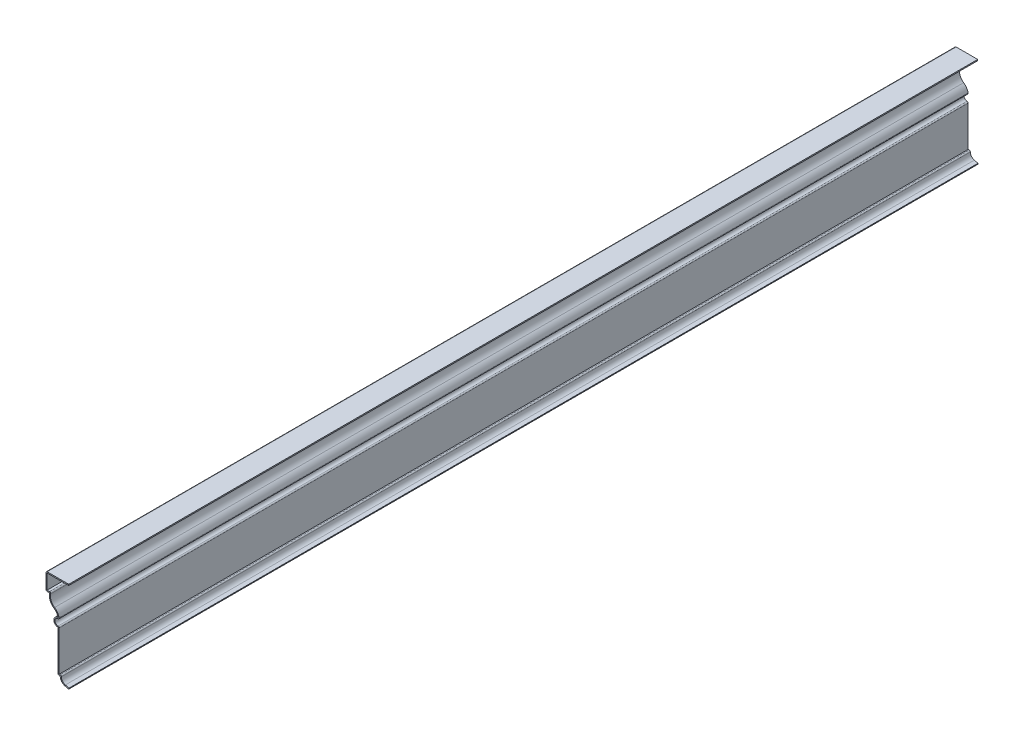
ISO-10303-21;
HEADER;
FILE_DESCRIPTION(('STEP AP214'),'2;1');
FILE_NAME('part.step','',(''),(''),'','','');
FILE_SCHEMA(('AUTOMOTIVE_DESIGN { 1 0 10303 214 1 1 1 1 }'));
ENDSEC;
DATA;
#1=APPLICATION_CONTEXT('core data for automotive mechanical design processes');
#2=APPLICATION_PROTOCOL_DEFINITION('international standard','automotive_design',2000,#1);
#3=PRODUCT_CONTEXT('',#1,'mechanical');
#4=PRODUCT('Part','Part','',(#3));
#5=PRODUCT_RELATED_PRODUCT_CATEGORY('part','',(#4));
#6=PRODUCT_DEFINITION_FORMATION('','',#4);
#7=PRODUCT_DEFINITION_CONTEXT('part definition',#1,'design');
#8=PRODUCT_DEFINITION('design','',#6,#7);
#9=PRODUCT_DEFINITION_SHAPE('','',#8);
#10=(LENGTH_UNIT() NAMED_UNIT(*) SI_UNIT(.MILLI.,.METRE.));
#11=(NAMED_UNIT(*) PLANE_ANGLE_UNIT() SI_UNIT($,.RADIAN.));
#12=(NAMED_UNIT(*) SI_UNIT($,.STERADIAN.) SOLID_ANGLE_UNIT());
#13=UNCERTAINTY_MEASURE_WITH_UNIT(LENGTH_MEASURE(1.E-05),#10,'distance_accuracy_value','');
#14=(GEOMETRIC_REPRESENTATION_CONTEXT(3) GLOBAL_UNCERTAINTY_ASSIGNED_CONTEXT((#13)) GLOBAL_UNIT_ASSIGNED_CONTEXT((#10,
#11,#12)) REPRESENTATION_CONTEXT('',''));
#15=CARTESIAN_POINT('',(0.,0.,0.));
#16=DIRECTION('',(0.,0.,1.));
#17=DIRECTION('',(1.,0.,0.));
#18=AXIS2_PLACEMENT_3D('',#15,#16,#17);
#19=CARTESIAN_POINT('',(-25.4,100.33,-1016.));
#20=DIRECTION('',(0.,-1.,0.));
#21=DIRECTION('',(0.,0.,-1.));
#22=AXIS2_PLACEMENT_3D('',#19,#20,#21);
#23=PLANE('',#22);
#24=DIRECTION('',(1.,0.,0.));
#25=VECTOR('',#24,1.);
#26=CARTESIAN_POINT('',(-25.4,100.33,0.));
#27=LINE('',#26,#25);
#28=CARTESIAN_POINT('',(-24.13,100.33,0.));
#29=VERTEX_POINT('',#28);
#30=CARTESIAN_POINT('',(0.,100.33,0.));
#31=VERTEX_POINT('',#30);
#32=EDGE_CURVE('E303',#29,#31,#27,.T.);
#33=ORIENTED_EDGE('',*,*,#32,.F.);
#34=DIRECTION('',(0.,0.,1.));
#35=VECTOR('',#34,1.);
#36=CARTESIAN_POINT('',(-24.13,100.33,-1016.));
#37=LINE('',#36,#35);
#38=CARTESIAN_POINT('',(-24.13,100.33,-1016.));
#39=VERTEX_POINT('',#38);
#40=EDGE_CURVE('E251',#39,#29,#37,.T.);
#41=ORIENTED_EDGE('',*,*,#40,.F.);
#42=DIRECTION('',(1.,0.,0.));
#43=VECTOR('',#42,1.);
#44=CARTESIAN_POINT('',(-25.4,100.33,-1016.));
#45=LINE('',#44,#43);
#46=CARTESIAN_POINT('',(0.,100.33,-1016.));
#47=VERTEX_POINT('',#46);
#48=EDGE_CURVE('E233',#39,#47,#45,.T.);
#49=ORIENTED_EDGE('',*,*,#48,.T.);
#50=DIRECTION('',(0.,0.,1.));
#51=VECTOR('',#50,1.);
#52=CARTESIAN_POINT('',(0.,100.33,-1016.));
#53=LINE('',#52,#51);
#54=EDGE_CURVE('E241',#47,#31,#53,.T.);
#55=ORIENTED_EDGE('',*,*,#54,.T.);
#56=EDGE_LOOP('',(#33,#41,#49,#55));
#57=FACE_BOUND('',#56,.T.);
#58=ADVANCED_FACE('F35',(#57),#23,.T.);
#59=CARTESIAN_POINT('',(-24.13,82.55,-1016.));
#60=DIRECTION('',(1.,0.,0.));
#61=DIRECTION('',(0.,0.,-1.));
#62=AXIS2_PLACEMENT_3D('',#59,#60,#61);
#63=PLANE('',#62);
#64=DIRECTION('',(0.,1.,0.));
#65=VECTOR('',#64,1.);
#66=CARTESIAN_POINT('',(-24.13,82.55,0.));
#67=LINE('',#66,#65);
#68=CARTESIAN_POINT('',(-24.13,83.82,0.));
#69=VERTEX_POINT('',#68);
#70=EDGE_CURVE('E252',#69,#29,#67,.T.);
#71=ORIENTED_EDGE('',*,*,#70,.F.);
#72=DIRECTION('',(0.,0.,1.));
#73=VECTOR('',#72,1.);
#74=CARTESIAN_POINT('',(-24.13,83.82,-1016.));
#75=LINE('',#74,#73);
#76=CARTESIAN_POINT('',(-24.13,83.82,-1016.));
#77=VERTEX_POINT('',#76);
#78=EDGE_CURVE('E352',#77,#69,#75,.T.);
#79=ORIENTED_EDGE('',*,*,#78,.F.);
#80=DIRECTION('',(0.,1.,0.));
#81=VECTOR('',#80,1.);
#82=CARTESIAN_POINT('',(-24.13,82.55,-1016.));
#83=LINE('',#82,#81);
#84=EDGE_CURVE('E249',#77,#39,#83,.T.);
#85=ORIENTED_EDGE('',*,*,#84,.T.);
#86=ORIENTED_EDGE('',*,*,#40,.T.);
#87=EDGE_LOOP('',(#71,#79,#85,#86));
#88=FACE_BOUND('',#87,.T.);
#89=ADVANCED_FACE('F465',(#88),#63,.T.);
#90=CARTESIAN_POINT('',(-21.43125,83.82,-1016.));
#91=DIRECTION('',(0.,1.,0.));
#92=DIRECTION('',(0.,0.,1.));
#93=AXIS2_PLACEMENT_3D('',#90,#91,#92);
#94=PLANE('',#93);
#95=DIRECTION('',(1.,0.,0.));
#96=VECTOR('',#95,1.);
#97=CARTESIAN_POINT('',(-21.43125,83.82,0.));
#98=LINE('',#97,#96);
#99=CARTESIAN_POINT('',(-21.43125,83.82,0.));
#100=VERTEX_POINT('',#99);
#101=EDGE_CURVE('E255',#100,#69,#98,.F.);
#102=ORIENTED_EDGE('',*,*,#101,.F.);
#103=DIRECTION('',(0.,0.,1.));
#104=VECTOR('',#103,1.);
#105=CARTESIAN_POINT('',(-21.43125,83.82,-1016.));
#106=LINE('',#105,#104);
#107=CARTESIAN_POINT('',(-21.43125,83.82,-1016.));
#108=VERTEX_POINT('',#107);
#109=EDGE_CURVE('E436',#100,#108,#106,.F.);
#110=ORIENTED_EDGE('',*,*,#109,.T.);
#111=DIRECTION('',(1.,0.,0.));
#112=VECTOR('',#111,1.);
#113=CARTESIAN_POINT('',(-21.43125,83.82,-1016.));
#114=LINE('',#113,#112);
#115=EDGE_CURVE('E300',#108,#77,#114,.F.);
#116=ORIENTED_EDGE('',*,*,#115,.T.);
#117=ORIENTED_EDGE('',*,*,#78,.T.);
#118=EDGE_LOOP('',(#102,#110,#116,#117));
#119=FACE_BOUND('',#118,.T.);
#120=ADVANCED_FACE('F570',(#119),#94,.T.);
#121=CARTESIAN_POINT('',(-9.80109653950941,80.0008198282702,-1016.));
#122=DIRECTION('',(0.,0.,1.));
#123=DIRECTION('',(1.,0.,0.));
#124=AXIS2_PLACEMENT_3D('',#121,#122,#123);
#125=CYLINDRICAL_SURFACE('',#124,10.63625);
#126=CARTESIAN_POINT('',(-9.80109653950941,80.0008198282702,-1016.));
#127=DIRECTION('',(0.,0.,1.));
#128=DIRECTION('',(1.,0.,0.));
#129=AXIS2_PLACEMENT_3D('',#126,#127,#128);
#130=CIRCLE('',#129,10.63625);
#131=CARTESIAN_POINT('',(-15.7716346624496,71.1984060351667,-1016.));
#132=VERTEX_POINT('',#131);
#133=CARTESIAN_POINT('',(-20.1907002975476,82.2780874483488,-1016.));
#134=VERTEX_POINT('',#133);
#135=EDGE_CURVE('E297',#132,#134,#130,.F.);
#136=ORIENTED_EDGE('',*,*,#135,.T.);
#137=DIRECTION('',(0.,0.,1.));
#138=VECTOR('',#137,1.);
#139=CARTESIAN_POINT('',(-20.1907002975476,82.2780874483488,-1016.));
#140=LINE('',#139,#138);
#141=CARTESIAN_POINT('',(-20.1907002975476,82.2780874483488,0.));
#142=VERTEX_POINT('',#141);
#143=EDGE_CURVE('E433',#134,#142,#140,.T.);
#144=ORIENTED_EDGE('',*,*,#143,.T.);
#145=CARTESIAN_POINT('',(-9.80109653950941,80.0008198282702,0.));
#146=DIRECTION('',(0.,0.,1.));
#147=DIRECTION('',(1.,0.,0.));
#148=AXIS2_PLACEMENT_3D('',#145,#146,#147);
#149=CIRCLE('',#148,10.63625);
#150=CARTESIAN_POINT('',(-15.7716346624496,71.1984060351667,0.));
#151=VERTEX_POINT('',#150);
#152=EDGE_CURVE('E346',#151,#142,#149,.F.);
#153=ORIENTED_EDGE('',*,*,#152,.F.);
#154=DIRECTION('',(0.,0.,1.));
#155=VECTOR('',#154,1.);
#156=CARTESIAN_POINT('',(-15.7716346624496,71.1984060351667,-1016.));
#157=LINE('',#156,#155);
#158=EDGE_CURVE('E355',#132,#151,#157,.T.);
#159=ORIENTED_EDGE('',*,*,#158,.F.);
#160=EDGE_LOOP('',(#136,#144,#153,#159));
#161=FACE_BOUND('',#160,.T.);
#162=ADVANCED_FACE('F476',(#161),#125,.F.);
#163=CARTESIAN_POINT('',(-22.7224103876636,60.9508198282702,-1016.));
#164=DIRECTION('',(0.,0.,1.));
#165=DIRECTION('',(1.,0.,0.));
#166=AXIS2_PLACEMENT_3D('',#163,#164,#165);
#167=CYLINDRICAL_SURFACE('',#166,12.3825);
#168=CARTESIAN_POINT('',(-22.7224103876636,60.9508198282702,0.));
#169=DIRECTION('',(0.,0.,1.));
#170=DIRECTION('',(1.,0.,0.));
#171=AXIS2_PLACEMENT_3D('',#168,#169,#170);
#172=CIRCLE('',#171,12.3825);
#173=CARTESIAN_POINT('',(-10.6701168088773,63.7913348767691,0.));
#174=VERTEX_POINT('',#173);
#175=EDGE_CURVE('E344',#174,#151,#172,.T.);
#176=ORIENTED_EDGE('',*,*,#175,.F.);
#177=DIRECTION('',(0.,0.,1.));
#178=VECTOR('',#177,1.);
#179=CARTESIAN_POINT('',(-10.6701168088773,63.7913348767691,-1016.));
#180=LINE('',#179,#178);
#181=CARTESIAN_POINT('',(-10.6701168088773,63.7913348767691,-1016.));
#182=VERTEX_POINT('',#181);
#183=EDGE_CURVE('E431',#174,#182,#180,.F.);
#184=ORIENTED_EDGE('',*,*,#183,.T.);
#185=CARTESIAN_POINT('',(-22.7224103876636,60.9508198282702,-1016.));
#186=DIRECTION('',(0.,0.,1.));
#187=DIRECTION('',(1.,0.,0.));
#188=AXIS2_PLACEMENT_3D('',#185,#186,#187);
#189=CIRCLE('',#188,12.3825);
#190=EDGE_CURVE('E295',#182,#132,#189,.T.);
#191=ORIENTED_EDGE('',*,*,#190,.T.);
#192=ORIENTED_EDGE('',*,*,#158,.T.);
#193=EDGE_LOOP('',(#176,#184,#191,#192));
#194=FACE_BOUND('',#193,.T.);
#195=ADVANCED_FACE('F481',(#194),#167,.T.);
#196=CARTESIAN_POINT('',(-11.90625,58.7375,-1016.));
#197=DIRECTION('',(0.,0.,1.));
#198=DIRECTION('',(1.,0.,0.));
#199=AXIS2_PLACEMENT_3D('',#196,#197,#198);
#200=CYLINDRICAL_SURFACE('',#199,3.49250000000002);
#201=CARTESIAN_POINT('',(-11.90625,58.7375,0.));
#202=DIRECTION('',(0.,0.,1.));
#203=DIRECTION('',(1.,0.,0.));
#204=AXIS2_PLACEMENT_3D('',#201,#202,#203);
#205=CIRCLE('',#204,3.49250000000002);
#206=CARTESIAN_POINT('',(-11.90625,55.245,0.));
#207=VERTEX_POINT('',#206);
#208=CARTESIAN_POINT('',(-11.9062496213247,62.23,0.));
#209=VERTEX_POINT('',#208);
#210=EDGE_CURVE('E341',#207,#209,#205,.F.);
#211=ORIENTED_EDGE('',*,*,#210,.F.);
#212=DIRECTION('',(0.,0.,1.));
#213=VECTOR('',#212,1.);
#214=CARTESIAN_POINT('',(-11.90625,55.245,-1016.));
#215=LINE('',#214,#213);
#216=CARTESIAN_POINT('',(-11.90625,55.245,-1016.));
#217=VERTEX_POINT('',#216);
#218=EDGE_CURVE('E429',#207,#217,#215,.F.);
#219=ORIENTED_EDGE('',*,*,#218,.T.);
#220=CARTESIAN_POINT('',(-11.90625,58.7375,-1016.));
#221=DIRECTION('',(0.,0.,1.));
#222=DIRECTION('',(1.,0.,0.));
#223=AXIS2_PLACEMENT_3D('',#220,#221,#222);
#224=CIRCLE('',#223,3.49250000000002);
#225=CARTESIAN_POINT('',(-11.9062496213247,62.23,-1016.));
#226=VERTEX_POINT('',#225);
#227=EDGE_CURVE('E292',#217,#226,#224,.F.);
#228=ORIENTED_EDGE('',*,*,#227,.T.);
#229=DIRECTION('',(0.,0.,1.));
#230=VECTOR('',#229,1.);
#231=CARTESIAN_POINT('',(-11.9062496213247,62.23,-1016.));
#232=LINE('',#231,#230);
#233=EDGE_CURVE('E426',#226,#209,#232,.T.);
#234=ORIENTED_EDGE('',*,*,#233,.T.);
#235=EDGE_LOOP('',(#211,#219,#228,#234));
#236=FACE_BOUND('',#235,.T.);
#237=ADVANCED_FACE('F490',(#236),#200,.F.);
#238=CARTESIAN_POINT('',(-10.63625,7.9375,-1016.));
#239=DIRECTION('',(1.,0.,0.));
#240=DIRECTION('',(0.,0.,-1.));
#241=AXIS2_PLACEMENT_3D('',#238,#239,#240);
#242=PLANE('',#241);
#243=DIRECTION('',(0.,1.,0.));
#244=VECTOR('',#243,1.);
#245=CARTESIAN_POINT('',(-10.63625,7.9375,-1016.));
#246=LINE('',#245,#244);
#247=CARTESIAN_POINT('',(-10.63625,9.2075,-1016.));
#248=VERTEX_POINT('',#247);
#249=CARTESIAN_POINT('',(-10.63625,53.975,-1016.));
#250=VERTEX_POINT('',#249);
#251=EDGE_CURVE('E289',#248,#250,#246,.T.);
#252=ORIENTED_EDGE('',*,*,#251,.T.);
#253=DIRECTION('',(0.,0.,1.));
#254=VECTOR('',#253,1.);
#255=CARTESIAN_POINT('',(-10.63625,53.975,-1016.));
#256=LINE('',#255,#254);
#257=CARTESIAN_POINT('',(-10.63625,53.975,0.));
#258=VERTEX_POINT('',#257);
#259=EDGE_CURVE('E423',#250,#258,#256,.T.);
#260=ORIENTED_EDGE('',*,*,#259,.T.);
#261=DIRECTION('',(0.,1.,0.));
#262=VECTOR('',#261,1.);
#263=CARTESIAN_POINT('',(-10.63625,7.9375,0.));
#264=LINE('',#263,#262);
#265=CARTESIAN_POINT('',(-10.63625,9.2075,0.));
#266=VERTEX_POINT('',#265);
#267=EDGE_CURVE('E338',#266,#258,#264,.T.);
#268=ORIENTED_EDGE('',*,*,#267,.F.);
#269=DIRECTION('',(0.,0.,1.));
#270=VECTOR('',#269,1.);
#271=CARTESIAN_POINT('',(-10.63625,9.2075,-1016.));
#272=LINE('',#271,#270);
#273=EDGE_CURVE('E358',#248,#266,#272,.T.);
#274=ORIENTED_EDGE('',*,*,#273,.F.);
#275=EDGE_LOOP('',(#252,#260,#268,#274));
#276=FACE_BOUND('',#275,.T.);
#277=ADVANCED_FACE('F498',(#276),#242,.T.);
#278=CARTESIAN_POINT('',(-9.525,9.2075,-1016.));
#279=DIRECTION('',(0.,1.,0.));
#280=DIRECTION('',(-1.,0.,0.));
#281=AXIS2_PLACEMENT_3D('',#278,#279,#280);
#282=PLANE('',#281);
#283=DIRECTION('',(-1.,0.,0.));
#284=VECTOR('',#283,1.);
#285=CARTESIAN_POINT('',(-9.525,9.2075,0.));
#286=LINE('',#285,#284);
#287=CARTESIAN_POINT('',(-9.525,9.2075,0.));
#288=VERTEX_POINT('',#287);
#289=EDGE_CURVE('E336',#288,#266,#286,.T.);
#290=ORIENTED_EDGE('',*,*,#289,.F.);
#291=DIRECTION('',(0.,0.,1.));
#292=VECTOR('',#291,1.);
#293=CARTESIAN_POINT('',(-9.525,9.2075,-1016.));
#294=LINE('',#293,#292);
#295=CARTESIAN_POINT('',(-9.525,9.2075,-1016.));
#296=VERTEX_POINT('',#295);
#297=EDGE_CURVE('E403',#288,#296,#294,.F.);
#298=ORIENTED_EDGE('',*,*,#297,.T.);
#299=DIRECTION('',(-1.,0.,0.));
#300=VECTOR('',#299,1.);
#301=CARTESIAN_POINT('',(-9.525,9.2075,-1016.));
#302=LINE('',#301,#300);
#303=EDGE_CURVE('E287',#296,#248,#302,.T.);
#304=ORIENTED_EDGE('',*,*,#303,.T.);
#305=ORIENTED_EDGE('',*,*,#273,.T.);
#306=EDGE_LOOP('',(#290,#298,#304,#305));
#307=FACE_BOUND('',#306,.T.);
#308=ADVANCED_FACE('F695',(#307),#282,.T.);
#309=CARTESIAN_POINT('',(-2.38125,7.9375,-1016.));
#310=DIRECTION('',(0.,0.,1.));
#311=DIRECTION('',(1.,0.,0.));
#312=AXIS2_PLACEMENT_3D('',#309,#310,#311);
#313=CYLINDRICAL_SURFACE('',#312,5.87375);
#314=CARTESIAN_POINT('',(-2.38125,7.9375,-1016.));
#315=DIRECTION('',(0.,0.,1.));
#316=DIRECTION('',(1.,0.,0.));
#317=AXIS2_PLACEMENT_3D('',#314,#315,#316);
#318=CIRCLE('',#317,5.87375);
#319=CARTESIAN_POINT('',(-3.77774894740654,2.23217531577804,-1016.));
#320=VERTEX_POINT('',#319);
#321=CARTESIAN_POINT('',(-8.255,7.9375,-1016.));
#322=VERTEX_POINT('',#321);
#323=EDGE_CURVE('E284',#320,#322,#318,.F.);
#324=ORIENTED_EDGE('',*,*,#323,.T.);
#325=DIRECTION('',(0.,0.,1.));
#326=VECTOR('',#325,1.);
#327=CARTESIAN_POINT('',(-8.255,7.9375,-1016.));
#328=LINE('',#327,#326);
#329=CARTESIAN_POINT('',(-8.255,7.9375,0.));
#330=VERTEX_POINT('',#329);
#331=EDGE_CURVE('E351',#322,#330,#328,.T.);
#332=ORIENTED_EDGE('',*,*,#331,.T.);
#333=CARTESIAN_POINT('',(-2.38125,7.9375,0.));
#334=DIRECTION('',(0.,0.,1.));
#335=DIRECTION('',(1.,0.,0.));
#336=AXIS2_PLACEMENT_3D('',#333,#334,#335);
#337=CIRCLE('',#336,5.87375);
#338=CARTESIAN_POINT('',(-3.77774894740654,2.23217531577804,0.));
#339=VERTEX_POINT('',#338);
#340=EDGE_CURVE('E333',#339,#330,#337,.F.);
#341=ORIENTED_EDGE('',*,*,#340,.F.);
#342=DIRECTION('',(0.,0.,1.));
#343=VECTOR('',#342,1.);
#344=CARTESIAN_POINT('',(-3.77774894740654,2.23217531577804,-1016.));
#345=LINE('',#344,#343);
#346=EDGE_CURVE('E361',#320,#339,#345,.T.);
#347=ORIENTED_EDGE('',*,*,#346,.F.);
#348=EDGE_LOOP('',(#324,#332,#341,#347));
#349=FACE_BOUND('',#348,.T.);
#350=ADVANCED_FACE('F510',(#349),#313,.F.);
#351=CARTESIAN_POINT('',(0.301945718358171,1.23358371550745,-1016.));
#352=DIRECTION('',(0.237752534140292,0.971325760242087,0.));
#353=DIRECTION('',(-0.971325760242088,0.237752534140292,0.));
#354=AXIS2_PLACEMENT_3D('',#351,#352,#353);
#355=PLANE('',#354);
#356=DIRECTION('',(-0.971325760242088,0.237752534140292,0.));
#357=VECTOR('',#356,1.);
#358=CARTESIAN_POINT('',(0.301945718358171,1.23358371550745,0.));
#359=LINE('',#358,#357);
#360=CARTESIAN_POINT('',(0.301945718358171,1.23358371550745,0.));
#361=VERTEX_POINT('',#360);
#362=EDGE_CURVE('E330',#361,#339,#359,.T.);
#363=ORIENTED_EDGE('',*,*,#362,.F.);
#364=DIRECTION('',(0.,0.,1.));
#365=VECTOR('',#364,1.);
#366=CARTESIAN_POINT('',(0.301945718358171,1.23358371550745,-1016.));
#367=LINE('',#366,#365);
#368=CARTESIAN_POINT('',(0.301945718358171,1.23358371550745,-1016.));
#369=VERTEX_POINT('',#368);
#370=EDGE_CURVE('E363',#369,#361,#367,.T.);
#371=ORIENTED_EDGE('',*,*,#370,.F.);
#372=DIRECTION('',(-0.971325760242088,0.237752534140292,0.));
#373=VECTOR('',#372,1.);
#374=CARTESIAN_POINT('',(0.301945718358171,1.23358371550745,-1016.));
#375=LINE('',#374,#373);
#376=EDGE_CURVE('E281',#369,#320,#375,.T.);
#377=ORIENTED_EDGE('',*,*,#376,.T.);
#378=ORIENTED_EDGE('',*,*,#346,.T.);
#379=EDGE_LOOP('',(#363,#371,#377,#378));
#380=FACE_BOUND('',#379,.T.);
#381=ADVANCED_FACE('F516',(#380),#355,.T.);
#382=CARTESIAN_POINT('',(0.301945718358171,1.23358371550745,-1016.));
#383=DIRECTION('',(-0.971325760242087,0.237752534140292,0.));
#384=DIRECTION('',(-0.237752534140292,-0.971325760242088,0.));
#385=AXIS2_PLACEMENT_3D('',#382,#383,#384);
#386=PLANE('',#385);
#387=DIRECTION('',(-0.237752534140292,-0.971325760242087,0.));
#388=VECTOR('',#387,1.);
#389=CARTESIAN_POINT('',(0.301945718358171,1.23358371550745,0.));
#390=LINE('',#389,#388);
#391=CARTESIAN_POINT('',(0.,0.,0.));
#392=VERTEX_POINT('',#391);
#393=EDGE_CURVE('E328',#361,#392,#390,.T.);
#394=ORIENTED_EDGE('',*,*,#393,.T.);
#395=DIRECTION('',(0.,0.,1.));
#396=VECTOR('',#395,1.);
#397=CARTESIAN_POINT('',(0.,0.,-1016.));
#398=LINE('',#397,#396);
#399=CARTESIAN_POINT('',(0.,0.,-1016.));
#400=VERTEX_POINT('',#399);
#401=EDGE_CURVE('E365',#400,#392,#398,.T.);
#402=ORIENTED_EDGE('',*,*,#401,.F.);
#403=DIRECTION('',(-0.237752534140292,-0.971325760242087,0.));
#404=VECTOR('',#403,1.);
#405=CARTESIAN_POINT('',(0.301945718358171,1.23358371550745,-1016.));
#406=LINE('',#405,#404);
#407=EDGE_CURVE('E279',#369,#400,#406,.T.);
#408=ORIENTED_EDGE('',*,*,#407,.F.);
#409=ORIENTED_EDGE('',*,*,#370,.T.);
#410=EDGE_LOOP('',(#394,#402,#408,#409));
#411=FACE_BOUND('',#410,.T.);
#412=ADVANCED_FACE('F523',(#411),#386,.F.);
#413=CARTESIAN_POINT('',(0.,0.,-1016.));
#414=DIRECTION('',(0.237752534140292,0.971325760242087,0.));
#415=DIRECTION('',(-0.971325760242087,0.237752534140292,0.));
#416=AXIS2_PLACEMENT_3D('',#413,#414,#415);
#417=PLANE('',#416);
#418=DIRECTION('',(-0.971325760242087,0.237752534140292,0.));
#419=VECTOR('',#418,1.);
#420=CARTESIAN_POINT('',(0.,0.,0.));
#421=LINE('',#420,#419);
#422=CARTESIAN_POINT('',(-4.07969466576471,0.998591600270589,0.));
#423=VERTEX_POINT('',#422);
#424=EDGE_CURVE('E326',#392,#423,#421,.T.);
#425=ORIENTED_EDGE('',*,*,#424,.T.);
#426=DIRECTION('',(0.,0.,1.));
#427=VECTOR('',#426,1.);
#428=CARTESIAN_POINT('',(-4.07969466576471,0.998591600270589,-1016.));
#429=LINE('',#428,#427);
#430=CARTESIAN_POINT('',(-4.07969466576471,0.998591600270589,-1016.));
#431=VERTEX_POINT('',#430);
#432=EDGE_CURVE('E368',#431,#423,#429,.T.);
#433=ORIENTED_EDGE('',*,*,#432,.F.);
#434=DIRECTION('',(-0.971325760242087,0.237752534140292,0.));
#435=VECTOR('',#434,1.);
#436=CARTESIAN_POINT('',(0.,0.,-1016.));
#437=LINE('',#436,#435);
#438=EDGE_CURVE('E277',#400,#431,#437,.T.);
#439=ORIENTED_EDGE('',*,*,#438,.F.);
#440=ORIENTED_EDGE('',*,*,#401,.T.);
#441=EDGE_LOOP('',(#425,#433,#439,#440));
#442=FACE_BOUND('',#441,.T.);
#443=ADVANCED_FACE('F525',(#442),#417,.F.);
#444=CARTESIAN_POINT('',(-2.38125,7.9375,-1016.));
#445=DIRECTION('',(0.,0.,1.));
#446=DIRECTION('',(1.,0.,0.));
#447=AXIS2_PLACEMENT_3D('',#444,#445,#446);
#448=CYLINDRICAL_SURFACE('',#447,7.14375);
#449=CARTESIAN_POINT('',(-2.38125,7.9375,0.));
#450=DIRECTION('',(0.,0.,-1.));
#451=DIRECTION('',(-1.,0.,0.));
#452=AXIS2_PLACEMENT_3D('',#449,#450,#451);
#453=CIRCLE('',#452,7.14375);
#454=CARTESIAN_POINT('',(-9.525,7.9375,0.));
#455=VERTEX_POINT('',#454);
#456=EDGE_CURVE('E324',#423,#455,#453,.T.);
#457=ORIENTED_EDGE('',*,*,#456,.T.);
#458=DIRECTION('',(0.,0.,1.));
#459=VECTOR('',#458,1.);
#460=CARTESIAN_POINT('',(-9.525,7.9375,-1016.));
#461=LINE('',#460,#459);
#462=CARTESIAN_POINT('',(-9.525,7.9375,-1016.));
#463=VERTEX_POINT('',#462);
#464=EDGE_CURVE('E371',#463,#455,#461,.T.);
#465=ORIENTED_EDGE('',*,*,#464,.F.);
#466=CARTESIAN_POINT('',(-2.38125,7.9375,-1016.));
#467=DIRECTION('',(0.,0.,-1.));
#468=DIRECTION('',(-1.,0.,0.));
#469=AXIS2_PLACEMENT_3D('',#466,#467,#468);
#470=CIRCLE('',#469,7.14375);
#471=EDGE_CURVE('E275',#431,#463,#470,.T.);
#472=ORIENTED_EDGE('',*,*,#471,.F.);
#473=ORIENTED_EDGE('',*,*,#432,.T.);
#474=EDGE_LOOP('',(#457,#465,#472,#473));
#475=FACE_BOUND('',#474,.T.);
#476=ADVANCED_FACE('F530',(#475),#448,.T.);
#477=CARTESIAN_POINT('',(-9.525,7.9375,-1016.));
#478=DIRECTION('',(0.,1.,0.));
#479=DIRECTION('',(-1.,0.,0.));
#480=AXIS2_PLACEMENT_3D('',#477,#478,#479);
#481=PLANE('',#480);
#482=DIRECTION('',(-1.,0.,0.));
#483=VECTOR('',#482,1.);
#484=CARTESIAN_POINT('',(-9.525,7.9375,0.));
#485=LINE('',#484,#483);
#486=CARTESIAN_POINT('',(-10.63625,7.9375,0.));
#487=VERTEX_POINT('',#486);
#488=EDGE_CURVE('E321',#455,#487,#485,.T.);
#489=ORIENTED_EDGE('',*,*,#488,.T.);
#490=DIRECTION('',(0.,0.,1.));
#491=VECTOR('',#490,1.);
#492=CARTESIAN_POINT('',(-10.63625,7.9375,-1016.));
#493=LINE('',#492,#491);
#494=CARTESIAN_POINT('',(-10.63625,7.9375,-1016.));
#495=VERTEX_POINT('',#494);
#496=EDGE_CURVE('E421',#487,#495,#493,.F.);
#497=ORIENTED_EDGE('',*,*,#496,.T.);
#498=DIRECTION('',(-1.,0.,0.));
#499=VECTOR('',#498,1.);
#500=CARTESIAN_POINT('',(-9.525,7.9375,-1016.));
#501=LINE('',#500,#499);
#502=EDGE_CURVE('E272',#463,#495,#501,.T.);
#503=ORIENTED_EDGE('',*,*,#502,.F.);
#504=ORIENTED_EDGE('',*,*,#464,.T.);
#505=EDGE_LOOP('',(#489,#497,#503,#504));
#506=FACE_BOUND('',#505,.T.);
#507=ADVANCED_FACE('F674',(#506),#481,.F.);
#508=CARTESIAN_POINT('',(-11.90625,7.9375,-1016.));
#509=DIRECTION('',(1.,0.,0.));
#510=DIRECTION('',(0.,0.,-1.));
#511=AXIS2_PLACEMENT_3D('',#508,#509,#510);
#512=PLANE('',#511);
#513=DIRECTION('',(0.,1.,0.));
#514=VECTOR('',#513,1.);
#515=CARTESIAN_POINT('',(-11.90625,7.9375,-1016.));
#516=LINE('',#515,#514);
#517=CARTESIAN_POINT('',(-11.90625,9.2075,-1016.));
#518=VERTEX_POINT('',#517);
#519=CARTESIAN_POINT('',(-11.90625,53.975,-1016.));
#520=VERTEX_POINT('',#519);
#521=EDGE_CURVE('E270',#518,#520,#516,.T.);
#522=ORIENTED_EDGE('',*,*,#521,.F.);
#523=DIRECTION('',(0.,0.,1.));
#524=VECTOR('',#523,1.);
#525=CARTESIAN_POINT('',(-11.90625,9.2075,-1016.));
#526=LINE('',#525,#524);
#527=CARTESIAN_POINT('',(-11.90625,9.2075,0.));
#528=VERTEX_POINT('',#527);
#529=EDGE_CURVE('E418',#518,#528,#526,.T.);
#530=ORIENTED_EDGE('',*,*,#529,.T.);
#531=DIRECTION('',(0.,1.,0.));
#532=VECTOR('',#531,1.);
#533=CARTESIAN_POINT('',(-11.90625,7.9375,0.));
#534=LINE('',#533,#532);
#535=CARTESIAN_POINT('',(-11.90625,53.975,0.));
#536=VERTEX_POINT('',#535);
#537=EDGE_CURVE('E319',#528,#536,#534,.T.);
#538=ORIENTED_EDGE('',*,*,#537,.T.);
#539=DIRECTION('',(0.,0.,1.));
#540=VECTOR('',#539,1.);
#541=CARTESIAN_POINT('',(-11.90625,53.975,-1016.));
#542=LINE('',#541,#540);
#543=EDGE_CURVE('E374',#520,#536,#542,.T.);
#544=ORIENTED_EDGE('',*,*,#543,.F.);
#545=EDGE_LOOP('',(#522,#530,#538,#544));
#546=FACE_BOUND('',#545,.T.);
#547=ADVANCED_FACE('F541',(#546),#512,.F.);
#548=CARTESIAN_POINT('',(-11.90625,58.7375,-1016.));
#549=DIRECTION('',(0.,0.,1.));
#550=DIRECTION('',(1.,0.,0.));
#551=AXIS2_PLACEMENT_3D('',#548,#549,#550);
#552=CYLINDRICAL_SURFACE('',#551,4.76250000000002);
#553=CARTESIAN_POINT('',(-11.90625,58.7375,0.));
#554=DIRECTION('',(0.,0.,-1.));
#555=DIRECTION('',(-1.,0.,0.));
#556=AXIS2_PLACEMENT_3D('',#553,#554,#555);
#557=CIRCLE('',#556,4.76250000000002);
#558=CARTESIAN_POINT('',(-11.9062494836246,63.5,0.));
#559=VERTEX_POINT('',#558);
#560=EDGE_CURVE('E317',#536,#559,#557,.T.);
#561=ORIENTED_EDGE('',*,*,#560,.T.);
#562=DIRECTION('',(0.,0.,1.));
#563=VECTOR('',#562,1.);
#564=CARTESIAN_POINT('',(-11.9062494836246,63.5,-1016.));
#565=LINE('',#564,#563);
#566=CARTESIAN_POINT('',(-11.9062494836246,63.5,-1016.));
#567=VERTEX_POINT('',#566);
#568=EDGE_CURVE('E377',#567,#559,#565,.T.);
#569=ORIENTED_EDGE('',*,*,#568,.F.);
#570=CARTESIAN_POINT('',(-11.90625,58.7375,-1016.));
#571=DIRECTION('',(0.,0.,-1.));
#572=DIRECTION('',(-1.,0.,0.));
#573=AXIS2_PLACEMENT_3D('',#570,#571,#572);
#574=CIRCLE('',#573,4.76250000000002);
#575=EDGE_CURVE('E268',#520,#567,#574,.T.);
#576=ORIENTED_EDGE('',*,*,#575,.F.);
#577=ORIENTED_EDGE('',*,*,#543,.T.);
#578=EDGE_LOOP('',(#561,#569,#576,#577));
#579=FACE_BOUND('',#578,.T.);
#580=ADVANCED_FACE('F549',(#579),#552,.T.);
#581=CARTESIAN_POINT('',(-22.7224103876636,60.9508198282702,-1016.));
#582=DIRECTION('',(0.,0.,1.));
#583=DIRECTION('',(1.,0.,0.));
#584=AXIS2_PLACEMENT_3D('',#581,#582,#583);
#585=CYLINDRICAL_SURFACE('',#584,11.1125);
#586=CARTESIAN_POINT('',(-22.7224103876636,60.9508198282702,0.));
#587=DIRECTION('',(0.,0.,1.));
#588=DIRECTION('',(1.,0.,0.));
#589=AXIS2_PLACEMENT_3D('',#586,#587,#588);
#590=CIRCLE('',#589,11.1125);
#591=CARTESIAN_POINT('',(-16.4845347368305,70.1473715524082,0.));
#592=VERTEX_POINT('',#591);
#593=EDGE_CURVE('E315',#559,#592,#590,.T.);
#594=ORIENTED_EDGE('',*,*,#593,.T.);
#595=DIRECTION('',(0.,0.,1.));
#596=VECTOR('',#595,1.);
#597=CARTESIAN_POINT('',(-16.4845347368305,70.1473715524082,-1016.));
#598=LINE('',#597,#596);
#599=CARTESIAN_POINT('',(-16.4845347368305,70.1473715524082,-1016.));
#600=VERTEX_POINT('',#599);
#601=EDGE_CURVE('E380',#600,#592,#598,.T.);
#602=ORIENTED_EDGE('',*,*,#601,.F.);
#603=CARTESIAN_POINT('',(-22.7224103876636,60.9508198282702,-1016.));
#604=DIRECTION('',(0.,0.,1.));
#605=DIRECTION('',(1.,0.,0.));
#606=AXIS2_PLACEMENT_3D('',#603,#604,#605);
#607=CIRCLE('',#606,11.1125);
#608=EDGE_CURVE('E266',#567,#600,#607,.T.);
#609=ORIENTED_EDGE('',*,*,#608,.F.);
#610=ORIENTED_EDGE('',*,*,#568,.T.);
#611=EDGE_LOOP('',(#594,#602,#609,#610));
#612=FACE_BOUND('',#611,.T.);
#613=ADVANCED_FACE('F553',(#612),#585,.F.);
#614=CARTESIAN_POINT('',(-9.80109653950941,80.0008198282702,-1016.));
#615=DIRECTION('',(0.,0.,1.));
#616=DIRECTION('',(1.,0.,0.));
#617=AXIS2_PLACEMENT_3D('',#614,#615,#616);
#618=CYLINDRICAL_SURFACE('',#617,11.90625);
#619=CARTESIAN_POINT('',(-9.80109653950941,80.0008198282702,0.));
#620=DIRECTION('',(0.,0.,-1.));
#621=DIRECTION('',(-1.,0.,0.));
#622=AXIS2_PLACEMENT_3D('',#619,#620,#621);
#623=CIRCLE('',#622,11.90625);
#624=CARTESIAN_POINT('',(-21.43125,82.55,0.));
#625=VERTEX_POINT('',#624);
#626=EDGE_CURVE('E313',#592,#625,#623,.T.);
#627=ORIENTED_EDGE('',*,*,#626,.T.);
#628=DIRECTION('',(0.,0.,1.));
#629=VECTOR('',#628,1.);
#630=CARTESIAN_POINT('',(-21.43125,82.55,-1016.));
#631=LINE('',#630,#629);
#632=CARTESIAN_POINT('',(-21.43125,82.55,-1016.));
#633=VERTEX_POINT('',#632);
#634=EDGE_CURVE('E383',#633,#625,#631,.T.);
#635=ORIENTED_EDGE('',*,*,#634,.F.);
#636=CARTESIAN_POINT('',(-9.80109653950941,80.0008198282702,-1016.));
#637=DIRECTION('',(0.,0.,-1.));
#638=DIRECTION('',(-1.,0.,0.));
#639=AXIS2_PLACEMENT_3D('',#636,#637,#638);
#640=CIRCLE('',#639,11.90625);
#641=EDGE_CURVE('E264',#600,#633,#640,.T.);
#642=ORIENTED_EDGE('',*,*,#641,.F.);
#643=ORIENTED_EDGE('',*,*,#601,.T.);
#644=EDGE_LOOP('',(#627,#635,#642,#643));
#645=FACE_BOUND('',#644,.T.);
#646=ADVANCED_FACE('F556',(#645),#618,.T.);
#647=CARTESIAN_POINT('',(-21.43125,82.55,-1016.));
#648=DIRECTION('',(0.,1.,0.));
#649=DIRECTION('',(0.,0.,1.));
#650=AXIS2_PLACEMENT_3D('',#647,#648,#649);
#651=PLANE('',#650);
#652=DIRECTION('',(-1.,0.,0.));
#653=VECTOR('',#652,1.);
#654=CARTESIAN_POINT('',(-21.43125,82.55,0.));
#655=LINE('',#654,#653);
#656=CARTESIAN_POINT('',(-24.13,82.55,0.));
#657=VERTEX_POINT('',#656);
#658=EDGE_CURVE('E310',#625,#657,#655,.T.);
#659=ORIENTED_EDGE('',*,*,#658,.T.);
#660=DIRECTION('',(0.,0.,1.));
#661=VECTOR('',#660,1.);
#662=CARTESIAN_POINT('',(-24.13,82.55,-1016.));
#663=LINE('',#662,#661);
#664=CARTESIAN_POINT('',(-24.13,82.55,-1016.));
#665=VERTEX_POINT('',#664);
#666=EDGE_CURVE('E43',#657,#665,#663,.F.);
#667=ORIENTED_EDGE('',*,*,#666,.T.);
#668=DIRECTION('',(-1.,0.,0.));
#669=VECTOR('',#668,1.);
#670=CARTESIAN_POINT('',(-21.43125,82.55,-1016.));
#671=LINE('',#670,#669);
#672=EDGE_CURVE('E261',#633,#665,#671,.T.);
#673=ORIENTED_EDGE('',*,*,#672,.F.);
#674=ORIENTED_EDGE('',*,*,#634,.T.);
#675=EDGE_LOOP('',(#659,#667,#673,#674));
#676=FACE_BOUND('',#675,.T.);
#677=ADVANCED_FACE('F444',(#676),#651,.F.);
#678=CARTESIAN_POINT('',(-25.4,82.55,-1016.));
#679=DIRECTION('',(1.,0.,0.));
#680=DIRECTION('',(0.,0.,-1.));
#681=AXIS2_PLACEMENT_3D('',#678,#679,#680);
#682=PLANE('',#681);
#683=DIRECTION('',(0.,1.,0.));
#684=VECTOR('',#683,1.);
#685=CARTESIAN_POINT('',(-25.4,82.55,-1016.));
#686=LINE('',#685,#684);
#687=CARTESIAN_POINT('',(-25.4,83.82,-1016.));
#688=VERTEX_POINT('',#687);
#689=CARTESIAN_POINT('',(-25.4,100.33,-1016.));
#690=VERTEX_POINT('',#689);
#691=EDGE_CURVE('E259',#688,#690,#686,.T.);
#692=ORIENTED_EDGE('',*,*,#691,.F.);
#693=DIRECTION('',(0.,0.,1.));
#694=VECTOR('',#693,1.);
#695=CARTESIAN_POINT('',(-25.4,83.82,-1016.));
#696=LINE('',#695,#694);
#697=CARTESIAN_POINT('',(-25.4,83.82,0.));
#698=VERTEX_POINT('',#697);
#699=EDGE_CURVE('E439',#688,#698,#696,.T.);
#700=ORIENTED_EDGE('',*,*,#699,.T.);
#701=DIRECTION('',(0.,1.,0.));
#702=VECTOR('',#701,1.);
#703=CARTESIAN_POINT('',(-25.4,82.55,0.));
#704=LINE('',#703,#702);
#705=CARTESIAN_POINT('',(-25.4,100.33,0.));
#706=VERTEX_POINT('',#705);
#707=EDGE_CURVE('E308',#698,#706,#704,.T.);
#708=ORIENTED_EDGE('',*,*,#707,.T.);
#709=DIRECTION('',(0.,0.,1.));
#710=VECTOR('',#709,1.);
#711=CARTESIAN_POINT('',(-25.4,100.33,-1016.));
#712=LINE('',#711,#710);
#713=EDGE_CURVE('E58',#706,#690,#712,.F.);
#714=ORIENTED_EDGE('',*,*,#713,.T.);
#715=EDGE_LOOP('',(#692,#700,#708,#714));
#716=FACE_BOUND('',#715,.T.);
#717=ADVANCED_FACE('F453',(#716),#682,.F.);
#718=CARTESIAN_POINT('',(-25.4,101.6,-1016.));
#719=DIRECTION('',(0.,-1.,0.));
#720=DIRECTION('',(0.,0.,-1.));
#721=AXIS2_PLACEMENT_3D('',#718,#719,#720);
#722=PLANE('',#721);
#723=DIRECTION('',(1.,0.,0.));
#724=VECTOR('',#723,1.);
#725=CARTESIAN_POINT('',(-25.4,101.6,-1016.));
#726=LINE('',#725,#724);
#727=CARTESIAN_POINT('',(-24.13,101.6,-1016.));
#728=VERTEX_POINT('',#727);
#729=CARTESIAN_POINT('',(0.,101.6,-1016.));
#730=VERTEX_POINT('',#729);
#731=EDGE_CURVE('E235',#728,#730,#726,.T.);
#732=ORIENTED_EDGE('',*,*,#731,.F.);
#733=DIRECTION('',(0.,0.,1.));
#734=VECTOR('',#733,1.);
#735=CARTESIAN_POINT('',(-24.13,101.6,-1016.));
#736=LINE('',#735,#734);
#737=CARTESIAN_POINT('',(-24.13,101.6,0.));
#738=VERTEX_POINT('',#737);
#739=EDGE_CURVE('E11',#728,#738,#736,.T.);
#740=ORIENTED_EDGE('',*,*,#739,.T.);
#741=DIRECTION('',(1.,0.,0.));
#742=VECTOR('',#741,1.);
#743=CARTESIAN_POINT('',(-25.4,101.6,0.));
#744=LINE('',#743,#742);
#745=CARTESIAN_POINT('',(0.,101.6,0.));
#746=VERTEX_POINT('',#745);
#747=EDGE_CURVE('E306',#738,#746,#744,.T.);
#748=ORIENTED_EDGE('',*,*,#747,.T.);
#749=DIRECTION('',(0.,0.,1.));
#750=VECTOR('',#749,1.);
#751=CARTESIAN_POINT('',(0.,101.6,-1016.));
#752=LINE('',#751,#750);
#753=EDGE_CURVE('E248',#730,#746,#752,.T.);
#754=ORIENTED_EDGE('',*,*,#753,.F.);
#755=EDGE_LOOP('',(#732,#740,#748,#754));
#756=FACE_BOUND('',#755,.T.);
#757=ADVANCED_FACE('F460',(#756),#722,.F.);
#758=CARTESIAN_POINT('',(0.,101.6,-1016.));
#759=DIRECTION('',(-1.,0.,0.));
#760=DIRECTION('',(0.,0.,1.));
#761=AXIS2_PLACEMENT_3D('',#758,#759,#760);
#762=PLANE('',#761);
#763=DIRECTION('',(0.,-1.,0.));
#764=VECTOR('',#763,1.);
#765=CARTESIAN_POINT('',(0.,101.6,0.));
#766=LINE('',#765,#764);
#767=EDGE_CURVE('E244',#746,#31,#766,.T.);
#768=ORIENTED_EDGE('',*,*,#767,.T.);
#769=ORIENTED_EDGE('',*,*,#54,.F.);
#770=DIRECTION('',(0.,-1.,0.));
#771=VECTOR('',#770,1.);
#772=CARTESIAN_POINT('',(0.,101.6,-1016.));
#773=LINE('',#772,#771);
#774=EDGE_CURVE('E227',#730,#47,#773,.T.);
#775=ORIENTED_EDGE('',*,*,#774,.F.);
#776=ORIENTED_EDGE('',*,*,#753,.T.);
#777=EDGE_LOOP('',(#768,#769,#775,#776));
#778=FACE_BOUND('',#777,.T.);
#779=ADVANCED_FACE('F242',(#778),#762,.F.);
#780=CARTESIAN_POINT('',(-9.80109653950941,80.0008198282702,-1016.));
#781=DIRECTION('',(0.,0.,-1.));
#782=DIRECTION('',(-1.,0.,0.));
#783=AXIS2_PLACEMENT_3D('',#780,#781,#782);
#784=PLANE('',#783);
#785=ORIENTED_EDGE('',*,*,#303,.F.);
#786=CARTESIAN_POINT('',(-9.525,7.9375,-1016.));
#787=DIRECTION('',(0.,0.,-1.));
#788=DIRECTION('',(-1.,0.,0.));
#789=AXIS2_PLACEMENT_3D('',#786,#787,#788);
#790=CIRCLE('',#789,1.27);
#791=EDGE_CURVE('E416',#296,#322,#790,.T.);
#792=ORIENTED_EDGE('',*,*,#791,.T.);
#793=ORIENTED_EDGE('',*,*,#323,.F.);
#794=ORIENTED_EDGE('',*,*,#376,.F.);
#795=ORIENTED_EDGE('',*,*,#407,.T.);
#796=ORIENTED_EDGE('',*,*,#438,.T.);
#797=ORIENTED_EDGE('',*,*,#471,.T.);
#798=ORIENTED_EDGE('',*,*,#502,.T.);
#799=CARTESIAN_POINT('',(-10.63625,9.2075,-1016.));
#800=DIRECTION('',(0.,0.,-1.));
#801=DIRECTION('',(-1.,0.,0.));
#802=AXIS2_PLACEMENT_3D('',#799,#800,#801);
#803=CIRCLE('',#802,1.27);
#804=EDGE_CURVE('E414',#495,#518,#803,.T.);
#805=ORIENTED_EDGE('',*,*,#804,.T.);
#806=ORIENTED_EDGE('',*,*,#521,.T.);
#807=ORIENTED_EDGE('',*,*,#575,.T.);
#808=ORIENTED_EDGE('',*,*,#608,.T.);
#809=ORIENTED_EDGE('',*,*,#641,.T.);
#810=ORIENTED_EDGE('',*,*,#672,.T.);
#811=CARTESIAN_POINT('',(-24.13,83.82,-1016.));
#812=DIRECTION('',(0.,0.,-1.));
#813=DIRECTION('',(-1.,0.,0.));
#814=AXIS2_PLACEMENT_3D('',#811,#812,#813);
#815=CIRCLE('',#814,1.27);
#816=EDGE_CURVE('E406',#665,#688,#815,.T.);
#817=ORIENTED_EDGE('',*,*,#816,.T.);
#818=ORIENTED_EDGE('',*,*,#691,.T.);
#819=CARTESIAN_POINT('',(-24.13,100.33,-1016.));
#820=DIRECTION('',(0.,0.,-1.));
#821=DIRECTION('',(-1.,0.,0.));
#822=AXIS2_PLACEMENT_3D('',#819,#820,#821);
#823=CIRCLE('',#822,1.27);
#824=EDGE_CURVE('E50',#690,#728,#823,.T.);
#825=ORIENTED_EDGE('',*,*,#824,.T.);
#826=ORIENTED_EDGE('',*,*,#731,.T.);
#827=ORIENTED_EDGE('',*,*,#774,.T.);
#828=ORIENTED_EDGE('',*,*,#48,.F.);
#829=ORIENTED_EDGE('',*,*,#84,.F.);
#830=ORIENTED_EDGE('',*,*,#115,.F.);
#831=CARTESIAN_POINT('',(-21.43125,82.55,-1016.));
#832=DIRECTION('',(0.,0.,-1.));
#833=DIRECTION('',(-1.,0.,0.));
#834=AXIS2_PLACEMENT_3D('',#831,#832,#833);
#835=CIRCLE('',#834,1.27);
#836=EDGE_CURVE('E408',#108,#134,#835,.T.);
#837=ORIENTED_EDGE('',*,*,#836,.T.);
#838=ORIENTED_EDGE('',*,*,#135,.F.);
#839=ORIENTED_EDGE('',*,*,#190,.F.);
#840=CARTESIAN_POINT('',(-11.9062494836246,63.5,-1016.));
#841=DIRECTION('',(0.,0.,-1.));
#842=DIRECTION('',(-1.,0.,0.));
#843=AXIS2_PLACEMENT_3D('',#840,#841,#842);
#844=CIRCLE('',#843,1.27);
#845=EDGE_CURVE('E410',#182,#226,#844,.T.);
#846=ORIENTED_EDGE('',*,*,#845,.T.);
#847=ORIENTED_EDGE('',*,*,#227,.F.);
#848=CARTESIAN_POINT('',(-11.90625,53.975,-1016.));
#849=DIRECTION('',(0.,0.,-1.));
#850=DIRECTION('',(-1.,0.,0.));
#851=AXIS2_PLACEMENT_3D('',#848,#849,#850);
#852=CIRCLE('',#851,1.27);
#853=EDGE_CURVE('E412',#217,#250,#852,.T.);
#854=ORIENTED_EDGE('',*,*,#853,.T.);
#855=ORIENTED_EDGE('',*,*,#251,.F.);
#856=EDGE_LOOP('',(#785,#792,#793,#794,#795,#796,#797,#798,#805,#806,#807,#808,#809,#810,#817,
#818,#825,#826,#827,#828,#829,#830,#837,#838,#839,#846,#847,#854,#855));
#857=FACE_BOUND('',#856,.T.);
#858=ADVANCED_FACE('F230',(#857),#784,.T.);
#859=CARTESIAN_POINT('',(-9.80109653950941,80.0008198282702,0.));
#860=DIRECTION('',(0.,0.,-1.));
#861=DIRECTION('',(-1.,0.,0.));
#862=AXIS2_PLACEMENT_3D('',#859,#860,#861);
#863=PLANE('',#862);
#864=ORIENTED_EDGE('',*,*,#340,.T.);
#865=CARTESIAN_POINT('',(-9.525,7.9375,0.));
#866=DIRECTION('',(0.,0.,-1.));
#867=DIRECTION('',(-1.,0.,0.));
#868=AXIS2_PLACEMENT_3D('',#865,#866,#867);
#869=CIRCLE('',#868,1.27);
#870=EDGE_CURVE('E401',#330,#288,#869,.F.);
#871=ORIENTED_EDGE('',*,*,#870,.T.);
#872=ORIENTED_EDGE('',*,*,#289,.T.);
#873=ORIENTED_EDGE('',*,*,#267,.T.);
#874=CARTESIAN_POINT('',(-11.90625,53.975,0.));
#875=DIRECTION('',(0.,0.,-1.));
#876=DIRECTION('',(-1.,0.,0.));
#877=AXIS2_PLACEMENT_3D('',#874,#875,#876);
#878=CIRCLE('',#877,1.27);
#879=EDGE_CURVE('E397',#258,#207,#878,.F.);
#880=ORIENTED_EDGE('',*,*,#879,.T.);
#881=ORIENTED_EDGE('',*,*,#210,.T.);
#882=CARTESIAN_POINT('',(-11.9062494836246,63.5,0.));
#883=DIRECTION('',(0.,0.,-1.));
#884=DIRECTION('',(-1.,0.,0.));
#885=AXIS2_PLACEMENT_3D('',#882,#883,#884);
#886=CIRCLE('',#885,1.27);
#887=EDGE_CURVE('E395',#209,#174,#886,.F.);
#888=ORIENTED_EDGE('',*,*,#887,.T.);
#889=ORIENTED_EDGE('',*,*,#175,.T.);
#890=ORIENTED_EDGE('',*,*,#152,.T.);
#891=CARTESIAN_POINT('',(-21.43125,82.55,0.));
#892=DIRECTION('',(0.,0.,-1.));
#893=DIRECTION('',(-1.,0.,0.));
#894=AXIS2_PLACEMENT_3D('',#891,#892,#893);
#895=CIRCLE('',#894,1.27);
#896=EDGE_CURVE('E393',#142,#100,#895,.F.);
#897=ORIENTED_EDGE('',*,*,#896,.T.);
#898=ORIENTED_EDGE('',*,*,#101,.T.);
#899=ORIENTED_EDGE('',*,*,#70,.T.);
#900=ORIENTED_EDGE('',*,*,#32,.T.);
#901=ORIENTED_EDGE('',*,*,#767,.F.);
#902=ORIENTED_EDGE('',*,*,#747,.F.);
#903=CARTESIAN_POINT('',(-24.13,100.33,0.));
#904=DIRECTION('',(0.,0.,-1.));
#905=DIRECTION('',(-1.,0.,0.));
#906=AXIS2_PLACEMENT_3D('',#903,#904,#905);
#907=CIRCLE('',#906,1.27);
#908=EDGE_CURVE('E389',#738,#706,#907,.F.);
#909=ORIENTED_EDGE('',*,*,#908,.T.);
#910=ORIENTED_EDGE('',*,*,#707,.F.);
#911=CARTESIAN_POINT('',(-24.13,83.82,0.));
#912=DIRECTION('',(0.,0.,-1.));
#913=DIRECTION('',(-1.,0.,0.));
#914=AXIS2_PLACEMENT_3D('',#911,#912,#913);
#915=CIRCLE('',#914,1.27);
#916=EDGE_CURVE('E391',#698,#657,#915,.F.);
#917=ORIENTED_EDGE('',*,*,#916,.T.);
#918=ORIENTED_EDGE('',*,*,#658,.F.);
#919=ORIENTED_EDGE('',*,*,#626,.F.);
#920=ORIENTED_EDGE('',*,*,#593,.F.);
#921=ORIENTED_EDGE('',*,*,#560,.F.);
#922=ORIENTED_EDGE('',*,*,#537,.F.);
#923=CARTESIAN_POINT('',(-10.63625,9.2075,0.));
#924=DIRECTION('',(0.,0.,-1.));
#925=DIRECTION('',(-1.,0.,0.));
#926=AXIS2_PLACEMENT_3D('',#923,#924,#925);
#927=CIRCLE('',#926,1.27);
#928=EDGE_CURVE('E399',#528,#487,#927,.F.);
#929=ORIENTED_EDGE('',*,*,#928,.T.);
#930=ORIENTED_EDGE('',*,*,#488,.F.);
#931=ORIENTED_EDGE('',*,*,#456,.F.);
#932=ORIENTED_EDGE('',*,*,#424,.F.);
#933=ORIENTED_EDGE('',*,*,#393,.F.);
#934=ORIENTED_EDGE('',*,*,#362,.T.);
#935=EDGE_LOOP('',(#864,#871,#872,#873,#880,#881,#888,#889,#890,#897,#898,#899,#900,#901,#902,
#909,#910,#917,#918,#919,#920,#921,#922,#929,#930,#931,#932,#933,#934));
#936=FACE_BOUND('',#935,.T.);
#937=ADVANCED_FACE('F455',(#936),#863,.F.);
#938=CARTESIAN_POINT('',(-9.525,7.9375,-1016.));
#939=DIRECTION('',(0.,0.,1.));
#940=DIRECTION('',(1.,0.,0.));
#941=AXIS2_PLACEMENT_3D('',#938,#939,#940);
#942=CYLINDRICAL_SURFACE('',#941,1.27);
#943=ORIENTED_EDGE('',*,*,#791,.F.);
#944=ORIENTED_EDGE('',*,*,#297,.F.);
#945=ORIENTED_EDGE('',*,*,#870,.F.);
#946=ORIENTED_EDGE('',*,*,#331,.F.);
#947=EDGE_LOOP('',(#943,#944,#945,#946));
#948=FACE_BOUND('',#947,.T.);
#949=ADVANCED_FACE('F507',(#948),#942,.T.);
#950=CARTESIAN_POINT('',(-10.63625,9.2075,-1016.));
#951=DIRECTION('',(0.,0.,1.));
#952=DIRECTION('',(1.,0.,0.));
#953=AXIS2_PLACEMENT_3D('',#950,#951,#952);
#954=CYLINDRICAL_SURFACE('',#953,1.27);
#955=ORIENTED_EDGE('',*,*,#804,.F.);
#956=ORIENTED_EDGE('',*,*,#496,.F.);
#957=ORIENTED_EDGE('',*,*,#928,.F.);
#958=ORIENTED_EDGE('',*,*,#529,.F.);
#959=EDGE_LOOP('',(#955,#956,#957,#958));
#960=FACE_BOUND('',#959,.T.);
#961=ADVANCED_FACE('F538',(#960),#954,.T.);
#962=CARTESIAN_POINT('',(-11.90625,53.975,-1016.));
#963=DIRECTION('',(0.,0.,1.));
#964=DIRECTION('',(1.,0.,0.));
#965=AXIS2_PLACEMENT_3D('',#962,#963,#964);
#966=CYLINDRICAL_SURFACE('',#965,1.27);
#967=ORIENTED_EDGE('',*,*,#853,.F.);
#968=ORIENTED_EDGE('',*,*,#218,.F.);
#969=ORIENTED_EDGE('',*,*,#879,.F.);
#970=ORIENTED_EDGE('',*,*,#259,.F.);
#971=EDGE_LOOP('',(#967,#968,#969,#970));
#972=FACE_BOUND('',#971,.T.);
#973=ADVANCED_FACE('F496',(#972),#966,.T.);
#974=CARTESIAN_POINT('',(-11.9062494836246,63.5,-1016.));
#975=DIRECTION('',(0.,0.,-1.));
#976=DIRECTION('',(-1.,0.,0.));
#977=AXIS2_PLACEMENT_3D('',#974,#975,#976);
#978=CYLINDRICAL_SURFACE('',#977,1.27);
#979=ORIENTED_EDGE('',*,*,#845,.F.);
#980=ORIENTED_EDGE('',*,*,#183,.F.);
#981=ORIENTED_EDGE('',*,*,#887,.F.);
#982=ORIENTED_EDGE('',*,*,#233,.F.);
#983=EDGE_LOOP('',(#979,#980,#981,#982));
#984=FACE_BOUND('',#983,.T.);
#985=ADVANCED_FACE('F487',(#984),#978,.T.);
#986=CARTESIAN_POINT('',(-21.43125,82.55,-1016.));
#987=DIRECTION('',(0.,0.,1.));
#988=DIRECTION('',(1.,0.,0.));
#989=AXIS2_PLACEMENT_3D('',#986,#987,#988);
#990=CYLINDRICAL_SURFACE('',#989,1.27);
#991=ORIENTED_EDGE('',*,*,#836,.F.);
#992=ORIENTED_EDGE('',*,*,#109,.F.);
#993=ORIENTED_EDGE('',*,*,#896,.F.);
#994=ORIENTED_EDGE('',*,*,#143,.F.);
#995=EDGE_LOOP('',(#991,#992,#993,#994));
#996=FACE_BOUND('',#995,.T.);
#997=ADVANCED_FACE('F473',(#996),#990,.T.);
#998=CARTESIAN_POINT('',(-24.13,83.82,-1016.));
#999=DIRECTION('',(0.,0.,1.));
#1000=DIRECTION('',(1.,0.,0.));
#1001=AXIS2_PLACEMENT_3D('',#998,#999,#1000);
#1002=CYLINDRICAL_SURFACE('',#1001,1.27);
#1003=ORIENTED_EDGE('',*,*,#816,.F.);
#1004=ORIENTED_EDGE('',*,*,#666,.F.);
#1005=ORIENTED_EDGE('',*,*,#916,.F.);
#1006=ORIENTED_EDGE('',*,*,#699,.F.);
#1007=EDGE_LOOP('',(#1003,#1004,#1005,#1006));
#1008=FACE_BOUND('',#1007,.T.);
#1009=ADVANCED_FACE('F451',(#1008),#1002,.T.);
#1010=CARTESIAN_POINT('',(-24.13,100.33,-1016.));
#1011=DIRECTION('',(0.,0.,1.));
#1012=DIRECTION('',(1.,0.,0.));
#1013=AXIS2_PLACEMENT_3D('',#1010,#1011,#1012);
#1014=CYLINDRICAL_SURFACE('',#1013,1.27);
#1015=ORIENTED_EDGE('',*,*,#824,.F.);
#1016=ORIENTED_EDGE('',*,*,#713,.F.);
#1017=ORIENTED_EDGE('',*,*,#908,.F.);
#1018=ORIENTED_EDGE('',*,*,#739,.F.);
#1019=EDGE_LOOP('',(#1015,#1016,#1017,#1018));
#1020=FACE_BOUND('',#1019,.T.);
#1021=ADVANCED_FACE('F37',(#1020),#1014,.T.);
#1022=CLOSED_SHELL('',(#58,#89,#120,#162,#195,#237,#277,#308,#350,#381,#412,#443,#476,#507,#547,
#580,#613,#646,#677,#717,#757,#779,#858,#937,#949,#961,#973,#985,#997,#1009,#1021));
#1023=MANIFOLD_SOLID_BREP('B2',#1022);
#1024=ADVANCED_BREP_SHAPE_REPRESENTATION('',(#18,#1023),#14);
#1025=SHAPE_DEFINITION_REPRESENTATION(#9,#1024);
ENDSEC;
END-ISO-10303-21;
